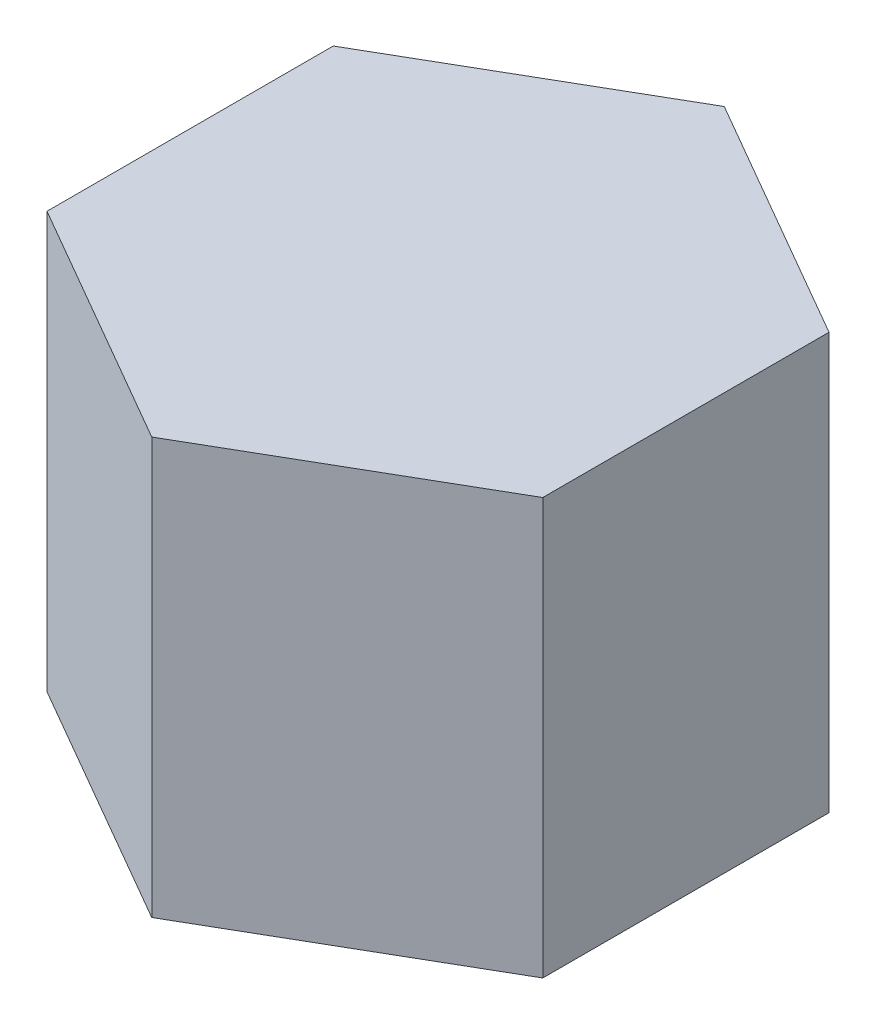
ISO-10303-21;
HEADER;
FILE_DESCRIPTION(('STEP AP214'),'2;1');
FILE_NAME('part.step','',(''),(''),'','','');
FILE_SCHEMA(('AUTOMOTIVE_DESIGN { 1 0 10303 214 1 1 1 1 }'));
ENDSEC;
DATA;
#1=APPLICATION_CONTEXT('core data for automotive mechanical design processes');
#2=APPLICATION_PROTOCOL_DEFINITION('international standard','automotive_design',2000,#1);
#3=PRODUCT_CONTEXT('',#1,'mechanical');
#4=PRODUCT('Part','Part','',(#3));
#5=PRODUCT_RELATED_PRODUCT_CATEGORY('part','',(#4));
#6=PRODUCT_DEFINITION_FORMATION('','',#4);
#7=PRODUCT_DEFINITION_CONTEXT('part definition',#1,'design');
#8=PRODUCT_DEFINITION('design','',#6,#7);
#9=PRODUCT_DEFINITION_SHAPE('','',#8);
#10=(LENGTH_UNIT() NAMED_UNIT(*) SI_UNIT(.MILLI.,.METRE.));
#11=(NAMED_UNIT(*) PLANE_ANGLE_UNIT() SI_UNIT($,.RADIAN.));
#12=(NAMED_UNIT(*) SI_UNIT($,.STERADIAN.) SOLID_ANGLE_UNIT());
#13=UNCERTAINTY_MEASURE_WITH_UNIT(LENGTH_MEASURE(1.E-05),#10,'distance_accuracy_value','');
#14=(GEOMETRIC_REPRESENTATION_CONTEXT(3) GLOBAL_UNCERTAINTY_ASSIGNED_CONTEXT((#13)) GLOBAL_UNIT_ASSIGNED_CONTEXT((#10,
#11,#12)) REPRESENTATION_CONTEXT('',''));
#15=CARTESIAN_POINT('',(0.,0.,0.));
#16=DIRECTION('',(0.,0.,1.));
#17=DIRECTION('',(1.,0.,0.));
#18=AXIS2_PLACEMENT_3D('',#15,#16,#17);
#19=CARTESIAN_POINT('',(207.339551417382,-147.556598747966,288.217869605357));
#20=DIRECTION('',(-0.499999999999943,0.,-0.866025403784471));
#21=DIRECTION('',(-0.866025403784471,0.,0.499999999999943));
#22=AXIS2_PLACEMENT_3D('',#19,#20,#21);
#23=PLANE('',#22);
#24=CARTESIAN_POINT('',(207.642660308706,-147.047793579175,288.042869605357));
#25=DIRECTION('',(-0.866025403784471,0.,0.499999999999943));
#26=VECTOR('',#25,1.);
#27=LINE('',#24,#26);
#28=CARTESIAN_POINT('',(207.642660308706,-147.047793579175,288.042869605357));
#29=VERTEX_POINT('',#28);
#30=CARTESIAN_POINT('',(207.339551417382,-147.047793579175,288.217869605357));
#31=VERTEX_POINT('',#30);
#32=EDGE_CURVE('E170',#29,#31,#27,.T.);
#33=ORIENTED_EDGE('',*,*,#32,.T.);
#34=CARTESIAN_POINT('',(207.339551417382,-147.556598747966,288.217869605357));
#35=DIRECTION('',(0.,1.,0.));
#36=VECTOR('',#35,1.);
#37=LINE('',#34,#36);
#38=CARTESIAN_POINT('',(207.339551417382,-147.556598747966,288.217869605357));
#39=VERTEX_POINT('',#38);
#40=EDGE_CURVE('E35',#39,#31,#37,.T.);
#41=ORIENTED_EDGE('',*,*,#40,.F.);
#42=CARTESIAN_POINT('',(207.642660308706,-147.556598747966,288.042869605357));
#43=DIRECTION('',(-0.866025403784471,0.,0.499999999999943));
#44=VECTOR('',#43,1.);
#45=LINE('',#42,#44);
#46=CARTESIAN_POINT('',(207.642660308706,-147.556598747966,288.042869605357));
#47=VERTEX_POINT('',#46);
#48=EDGE_CURVE('E159',#47,#39,#45,.T.);
#49=ORIENTED_EDGE('',*,*,#48,.F.);
#50=CARTESIAN_POINT('',(207.642660308706,-147.556598747966,288.042869605357));
#51=DIRECTION('',(0.,1.,0.));
#52=VECTOR('',#51,1.);
#53=LINE('',#50,#52);
#54=EDGE_CURVE('E10',#47,#29,#53,.T.);
#55=ORIENTED_EDGE('',*,*,#54,.T.);
#56=EDGE_LOOP('',(#33,#41,#49,#55));
#57=FACE_BOUND('',#56,.T.);
#58=ADVANCED_FACE('F16',(#57),#23,.F.);
#59=CARTESIAN_POINT('',(207.642660308706,-147.556598747966,291.594471220494));
#60=DIRECTION('',(-1.,0.,0.));
#61=DIRECTION('',(0.,-1.,0.));
#62=AXIS2_PLACEMENT_3D('',#59,#60,#61);
#63=PLANE('',#62);
#64=CARTESIAN_POINT('',(207.642660308706,-147.047793579175,287.692869605357));
#65=DIRECTION('',(0.,0.,1.));
#66=VECTOR('',#65,1.);
#67=LINE('',#64,#66);
#68=CARTESIAN_POINT('',(207.642660308706,-147.047793579175,287.692869605357));
#69=VERTEX_POINT('',#68);
#70=EDGE_CURVE('E167',#69,#29,#67,.T.);
#71=ORIENTED_EDGE('',*,*,#70,.T.);
#72=ORIENTED_EDGE('',*,*,#54,.F.);
#73=CARTESIAN_POINT('',(207.642660308706,-147.556598747966,287.692869605357));
#74=DIRECTION('',(0.,0.,1.));
#75=VECTOR('',#74,1.);
#76=LINE('',#73,#75);
#77=CARTESIAN_POINT('',(207.642660308706,-147.556598747966,287.692869605357));
#78=VERTEX_POINT('',#77);
#79=EDGE_CURVE('E156',#78,#47,#76,.T.);
#80=ORIENTED_EDGE('',*,*,#79,.F.);
#81=CARTESIAN_POINT('',(207.642660308706,-147.556598747966,287.692869605357));
#82=DIRECTION('',(0.,1.,0.));
#83=VECTOR('',#82,1.);
#84=LINE('',#81,#83);
#85=EDGE_CURVE('E27',#78,#69,#84,.T.);
#86=ORIENTED_EDGE('',*,*,#85,.T.);
#87=EDGE_LOOP('',(#71,#72,#80,#86));
#88=FACE_BOUND('',#87,.T.);
#89=ADVANCED_FACE('F189',(#88),#63,.F.);
#90=CARTESIAN_POINT('',(207.642660308706,-147.556598747966,287.692869605357));
#91=DIRECTION('',(-0.499999999999943,0.,0.866025403784471));
#92=DIRECTION('',(0.866025403784471,0.,0.499999999999943));
#93=AXIS2_PLACEMENT_3D('',#90,#91,#92);
#94=PLANE('',#93);
#95=CARTESIAN_POINT('',(207.339551417382,-147.047793579175,287.517869605357));
#96=DIRECTION('',(0.866025403784471,0.,0.499999999999943));
#97=VECTOR('',#96,1.);
#98=LINE('',#95,#97);
#99=CARTESIAN_POINT('',(207.339551417382,-147.047793579175,287.517869605357));
#100=VERTEX_POINT('',#99);
#101=EDGE_CURVE('E163',#100,#69,#98,.T.);
#102=ORIENTED_EDGE('',*,*,#101,.T.);
#103=ORIENTED_EDGE('',*,*,#85,.F.);
#104=CARTESIAN_POINT('',(207.339551417382,-147.556598747966,287.517869605357));
#105=DIRECTION('',(0.866025403784471,0.,0.499999999999943));
#106=VECTOR('',#105,1.);
#107=LINE('',#104,#106);
#108=CARTESIAN_POINT('',(207.339551417382,-147.556598747966,287.517869605357));
#109=VERTEX_POINT('',#108);
#110=EDGE_CURVE('E106',#109,#78,#107,.T.);
#111=ORIENTED_EDGE('',*,*,#110,.F.);
#112=CARTESIAN_POINT('',(207.339551417382,-147.556598747966,287.517869605357));
#113=DIRECTION('',(0.,1.,0.));
#114=VECTOR('',#113,1.);
#115=LINE('',#112,#114);
#116=EDGE_CURVE('E94',#109,#100,#115,.T.);
#117=ORIENTED_EDGE('',*,*,#116,.T.);
#118=EDGE_LOOP('',(#102,#103,#111,#117));
#119=FACE_BOUND('',#118,.T.);
#120=ADVANCED_FACE('F198',(#119),#94,.F.);
#121=CARTESIAN_POINT('',(207.339551417382,-147.556598747966,287.517869605357));
#122=DIRECTION('',(0.499999999999978,0.,0.866025403784452));
#123=DIRECTION('',(0.866025403784452,0.,-0.499999999999978));
#124=AXIS2_PLACEMENT_3D('',#121,#122,#123);
#125=PLANE('',#124);
#126=CARTESIAN_POINT('',(207.036442526057,-147.047793579175,287.692869605357));
#127=DIRECTION('',(0.866025403784452,0.,-0.499999999999978));
#128=VECTOR('',#127,1.);
#129=LINE('',#126,#128);
#130=CARTESIAN_POINT('',(207.036442526057,-147.047793579175,287.692869605357));
#131=VERTEX_POINT('',#130);
#132=EDGE_CURVE('E162',#131,#100,#129,.T.);
#133=ORIENTED_EDGE('',*,*,#132,.T.);
#134=ORIENTED_EDGE('',*,*,#116,.F.);
#135=CARTESIAN_POINT('',(207.036442526057,-147.556598747966,287.692869605357));
#136=DIRECTION('',(0.866025403784452,0.,-0.499999999999978));
#137=VECTOR('',#136,1.);
#138=LINE('',#135,#137);
#139=CARTESIAN_POINT('',(207.036442526057,-147.556598747966,287.692869605357));
#140=VERTEX_POINT('',#139);
#141=EDGE_CURVE('E98',#140,#109,#138,.T.);
#142=ORIENTED_EDGE('',*,*,#141,.F.);
#143=CARTESIAN_POINT('',(207.036442526057,-147.556598747966,287.692869605357));
#144=DIRECTION('',(0.,1.,0.));
#145=VECTOR('',#144,1.);
#146=LINE('',#143,#145);
#147=EDGE_CURVE('E79',#140,#131,#146,.T.);
#148=ORIENTED_EDGE('',*,*,#147,.T.);
#149=EDGE_LOOP('',(#133,#134,#142,#148));
#150=FACE_BOUND('',#149,.T.);
#151=ADVANCED_FACE('F100',(#150),#125,.F.);
#152=CARTESIAN_POINT('',(207.036442526057,-147.556598747966,291.594471220494));
#153=DIRECTION('',(1.,0.,0.));
#154=DIRECTION('',(0.,1.,0.));
#155=AXIS2_PLACEMENT_3D('',#152,#153,#154);
#156=PLANE('',#155);
#157=CARTESIAN_POINT('',(207.036442526057,-147.047793579175,288.042869605357));
#158=DIRECTION('',(0.,0.,-1.));
#159=VECTOR('',#158,1.);
#160=LINE('',#157,#159);
#161=CARTESIAN_POINT('',(207.036442526057,-147.047793579175,288.042869605357));
#162=VERTEX_POINT('',#161);
#163=EDGE_CURVE('E88',#162,#131,#160,.T.);
#164=ORIENTED_EDGE('',*,*,#163,.T.);
#165=ORIENTED_EDGE('',*,*,#147,.F.);
#166=CARTESIAN_POINT('',(207.036442526057,-147.556598747966,288.042869605357));
#167=DIRECTION('',(0.,0.,-1.));
#168=VECTOR('',#167,1.);
#169=LINE('',#166,#168);
#170=CARTESIAN_POINT('',(207.036442526057,-147.556598747966,288.042869605357));
#171=VERTEX_POINT('',#170);
#172=EDGE_CURVE('E84',#171,#140,#169,.T.);
#173=ORIENTED_EDGE('',*,*,#172,.F.);
#174=CARTESIAN_POINT('',(207.036442526057,-147.556598747966,288.042869605357));
#175=DIRECTION('',(0.,1.,0.));
#176=VECTOR('',#175,1.);
#177=LINE('',#174,#176);
#178=EDGE_CURVE('E58',#171,#162,#177,.T.);
#179=ORIENTED_EDGE('',*,*,#178,.T.);
#180=EDGE_LOOP('',(#164,#165,#173,#179));
#181=FACE_BOUND('',#180,.T.);
#182=ADVANCED_FACE('F82',(#181),#156,.F.);
#183=CARTESIAN_POINT('',(207.036442526057,-147.556598747966,288.042869605357));
#184=DIRECTION('',(0.499999999999978,0.,-0.866025403784452));
#185=DIRECTION('',(-0.866025403784452,0.,-0.499999999999978));
#186=AXIS2_PLACEMENT_3D('',#183,#184,#185);
#187=PLANE('',#186);
#188=CARTESIAN_POINT('',(207.339551417382,-147.047793579175,288.217869605357));
#189=DIRECTION('',(-0.866025403784452,0.,-0.499999999999978));
#190=VECTOR('',#189,1.);
#191=LINE('',#188,#190);
#192=EDGE_CURVE('E160',#31,#162,#191,.T.);
#193=ORIENTED_EDGE('',*,*,#192,.T.);
#194=ORIENTED_EDGE('',*,*,#178,.F.);
#195=CARTESIAN_POINT('',(207.339551417382,-147.556598747966,288.217869605357));
#196=DIRECTION('',(-0.866025403784452,0.,-0.499999999999978));
#197=VECTOR('',#196,1.);
#198=LINE('',#195,#197);
#199=EDGE_CURVE('E112',#39,#171,#198,.T.);
#200=ORIENTED_EDGE('',*,*,#199,.F.);
#201=ORIENTED_EDGE('',*,*,#40,.T.);
#202=EDGE_LOOP('',(#193,#194,#200,#201));
#203=FACE_BOUND('',#202,.T.);
#204=ADVANCED_FACE('F131',(#203),#187,.F.);
#205=CARTESIAN_POINT('',(206.491105863044,-147.556598747966,291.594471220494));
#206=DIRECTION('',(0.,1.,0.));
#207=DIRECTION('',(-1.,0.,0.));
#208=AXIS2_PLACEMENT_3D('',#205,#206,#207);
#209=PLANE('',#208);
#210=ORIENTED_EDGE('',*,*,#48,.T.);
#211=ORIENTED_EDGE('',*,*,#199,.T.);
#212=ORIENTED_EDGE('',*,*,#172,.T.);
#213=ORIENTED_EDGE('',*,*,#141,.T.);
#214=ORIENTED_EDGE('',*,*,#110,.T.);
#215=ORIENTED_EDGE('',*,*,#79,.T.);
#216=EDGE_LOOP('',(#210,#211,#212,#213,#214,#215));
#217=FACE_BOUND('',#216,.T.);
#218=ADVANCED_FACE('F111',(#217),#209,.F.);
#219=CARTESIAN_POINT('',(206.491105863044,-147.047793579175,291.594471220494));
#220=DIRECTION('',(0.,1.,0.));
#221=DIRECTION('',(-1.,0.,0.));
#222=AXIS2_PLACEMENT_3D('',#219,#220,#221);
#223=PLANE('',#222);
#224=ORIENTED_EDGE('',*,*,#32,.F.);
#225=ORIENTED_EDGE('',*,*,#70,.F.);
#226=ORIENTED_EDGE('',*,*,#101,.F.);
#227=ORIENTED_EDGE('',*,*,#132,.F.);
#228=ORIENTED_EDGE('',*,*,#163,.F.);
#229=ORIENTED_EDGE('',*,*,#192,.F.);
#230=EDGE_LOOP('',(#224,#225,#226,#227,#228,#229));
#231=FACE_BOUND('',#230,.T.);
#232=ADVANCED_FACE('F130',(#231),#223,.T.);
#233=CLOSED_SHELL('',(#58,#89,#120,#151,#182,#204,#218,#232));
#234=MANIFOLD_SOLID_BREP('B1',#233);
#235=ADVANCED_BREP_SHAPE_REPRESENTATION('',(#18,#234),#14);
#236=SHAPE_DEFINITION_REPRESENTATION(#9,#235);
ENDSEC;
END-ISO-10303-21;
